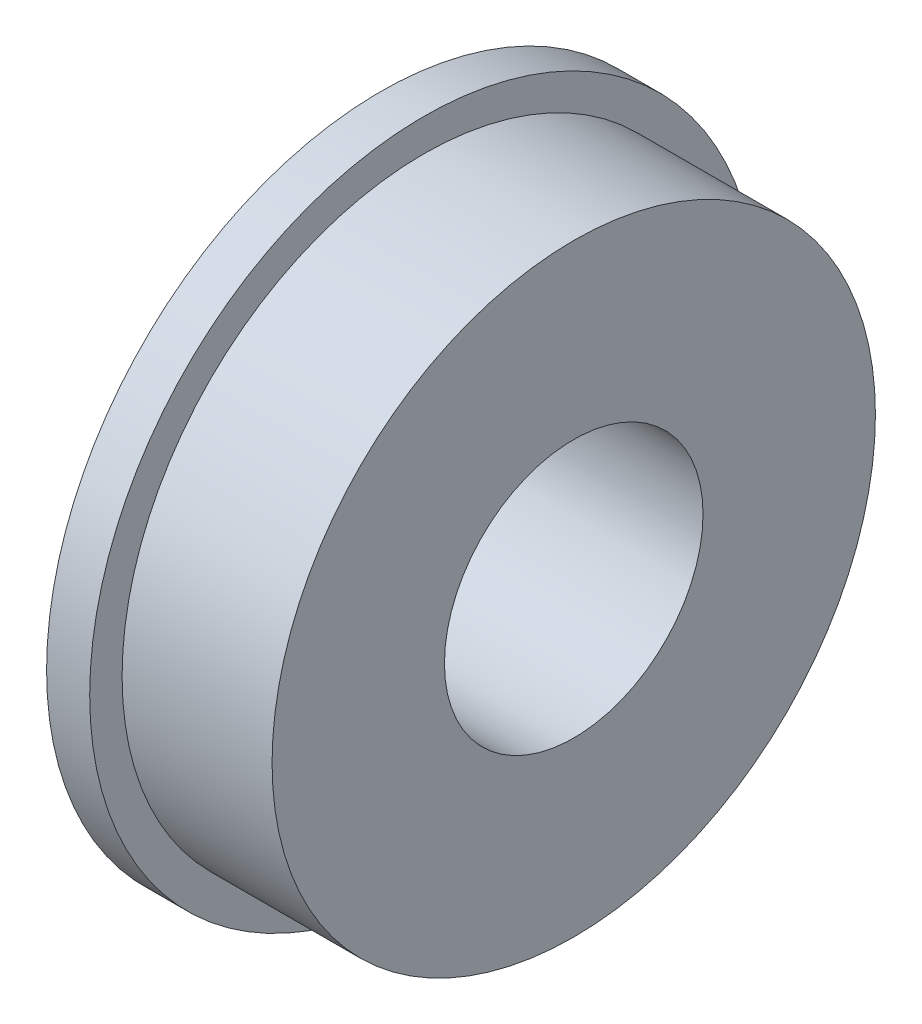
ISO-10303-21;
HEADER;
FILE_DESCRIPTION(('STEP AP214'),'2;1');
FILE_NAME('part.step','',(''),(''),'','','');
FILE_SCHEMA(('AUTOMOTIVE_DESIGN { 1 0 10303 214 1 1 1 1 }'));
ENDSEC;
DATA;
#1=APPLICATION_CONTEXT('core data for automotive mechanical design processes');
#2=APPLICATION_PROTOCOL_DEFINITION('international standard','automotive_design',2000,#1);
#3=PRODUCT_CONTEXT('',#1,'mechanical');
#4=PRODUCT('Part','Part','',(#3));
#5=PRODUCT_RELATED_PRODUCT_CATEGORY('part','',(#4));
#6=PRODUCT_DEFINITION_FORMATION('','',#4);
#7=PRODUCT_DEFINITION_CONTEXT('part definition',#1,'design');
#8=PRODUCT_DEFINITION('design','',#6,#7);
#9=PRODUCT_DEFINITION_SHAPE('','',#8);
#10=(LENGTH_UNIT() NAMED_UNIT(*) SI_UNIT(.MILLI.,.METRE.));
#11=(NAMED_UNIT(*) PLANE_ANGLE_UNIT() SI_UNIT($,.RADIAN.));
#12=(NAMED_UNIT(*) SI_UNIT($,.STERADIAN.) SOLID_ANGLE_UNIT());
#13=UNCERTAINTY_MEASURE_WITH_UNIT(LENGTH_MEASURE(1.E-05),#10,'distance_accuracy_value','');
#14=(GEOMETRIC_REPRESENTATION_CONTEXT(3) GLOBAL_UNCERTAINTY_ASSIGNED_CONTEXT((#13)) GLOBAL_UNIT_ASSIGNED_CONTEXT((#10,
#11,#12)) REPRESENTATION_CONTEXT('',''));
#15=CARTESIAN_POINT('',(0.,0.,0.));
#16=DIRECTION('',(0.,0.,1.));
#17=DIRECTION('',(1.,0.,0.));
#18=AXIS2_PLACEMENT_3D('',#15,#16,#17);
#19=CARTESIAN_POINT('',(0.,0.,0.));
#20=DIRECTION('',(-1.,0.,0.));
#21=DIRECTION('',(0.,0.,1.));
#22=AXIS2_PLACEMENT_3D('',#19,#20,#21);
#23=CYLINDRICAL_SURFACE('',#22,9.906);
#24=CARTESIAN_POINT('',(0.381,0.,0.));
#25=DIRECTION('',(-1.,0.,0.));
#26=DIRECTION('',(0.,0.,1.));
#27=AXIS2_PLACEMENT_3D('',#24,#25,#26);
#28=CIRCLE('',#27,9.906);
#29=CARTESIAN_POINT('',(0.381,0.,9.906));
#30=VERTEX_POINT('',#29);
#31=EDGE_CURVE('E46',#30,#30,#28,.F.);
#32=ORIENTED_EDGE('',*,*,#31,.T.);
#33=EDGE_LOOP('',(#32));
#34=FACE_BOUND('',#33,.T.);
#35=CARTESIAN_POINT('',(0.,0.,0.));
#36=DIRECTION('',(-1.,0.,0.));
#37=DIRECTION('',(0.,0.,1.));
#38=AXIS2_PLACEMENT_3D('',#35,#36,#37);
#39=CIRCLE('',#38,9.906);
#40=CARTESIAN_POINT('',(0.,0.,9.906));
#41=VERTEX_POINT('',#40);
#42=EDGE_CURVE('E18',#41,#41,#39,.T.);
#43=ORIENTED_EDGE('',*,*,#42,.T.);
#44=EDGE_LOOP('',(#43));
#45=FACE_BOUND('',#44,.T.);
#46=ADVANCED_FACE('F15',(#34,#45),#23,.F.);
#47=CARTESIAN_POINT('',(0.,12.3063,0.));
#48=DIRECTION('',(1.,0.,0.));
#49=DIRECTION('',(0.,0.,-1.));
#50=AXIS2_PLACEMENT_3D('',#47,#48,#49);
#51=PLANE('',#50);
#52=CARTESIAN_POINT('',(0.,0.,0.));
#53=DIRECTION('',(-1.,0.,0.));
#54=DIRECTION('',(0.,0.,1.));
#55=AXIS2_PLACEMENT_3D('',#52,#53,#54);
#56=CIRCLE('',#55,12.3063);
#57=CARTESIAN_POINT('',(0.,0.,12.3063));
#58=VERTEX_POINT('',#57);
#59=EDGE_CURVE('E44',#58,#58,#56,.F.);
#60=ORIENTED_EDGE('',*,*,#59,.F.);
#61=EDGE_LOOP('',(#60));
#62=FACE_BOUND('',#61,.T.);
#63=ORIENTED_EDGE('',*,*,#42,.F.);
#64=EDGE_LOOP('',(#63));
#65=FACE_BOUND('',#64,.T.);
#66=ADVANCED_FACE('F54',(#62,#65),#51,.F.);
#67=CARTESIAN_POINT('',(0.381,9.906,0.));
#68=DIRECTION('',(1.,0.,0.));
#69=DIRECTION('',(0.,0.,-1.));
#70=AXIS2_PLACEMENT_3D('',#67,#68,#69);
#71=PLANE('',#70);
#72=ORIENTED_EDGE('',*,*,#31,.F.);
#73=EDGE_LOOP('',(#72));
#74=FACE_BOUND('',#73,.T.);
#75=CARTESIAN_POINT('',(0.381,0.,0.));
#76=DIRECTION('',(-1.,0.,0.));
#77=DIRECTION('',(0.,0.,1.));
#78=AXIS2_PLACEMENT_3D('',#75,#76,#77);
#79=CIRCLE('',#78,6.35);
#80=CARTESIAN_POINT('',(0.381,0.,6.35));
#81=VERTEX_POINT('',#80);
#82=EDGE_CURVE('E41',#81,#81,#79,.T.);
#83=ORIENTED_EDGE('',*,*,#82,.F.);
#84=EDGE_LOOP('',(#83));
#85=FACE_BOUND('',#84,.T.);
#86=ADVANCED_FACE('F56',(#74,#85),#71,.F.);
#87=CARTESIAN_POINT('',(0.,0.,0.));
#88=DIRECTION('',(-1.,0.,0.));
#89=DIRECTION('',(0.,0.,1.));
#90=AXIS2_PLACEMENT_3D('',#87,#88,#89);
#91=CYLINDRICAL_SURFACE('',#90,12.3063);
#92=ORIENTED_EDGE('',*,*,#59,.T.);
#93=EDGE_LOOP('',(#92));
#94=FACE_BOUND('',#93,.T.);
#95=CARTESIAN_POINT('',(1.5875,0.,0.));
#96=DIRECTION('',(-1.,0.,0.));
#97=DIRECTION('',(0.,0.,1.));
#98=AXIS2_PLACEMENT_3D('',#95,#96,#97);
#99=CIRCLE('',#98,12.3063);
#100=CARTESIAN_POINT('',(1.5875,0.,12.3063));
#101=VERTEX_POINT('',#100);
#102=EDGE_CURVE('E38',#101,#101,#99,.T.);
#103=ORIENTED_EDGE('',*,*,#102,.T.);
#104=EDGE_LOOP('',(#103));
#105=FACE_BOUND('',#104,.T.);
#106=ADVANCED_FACE('F63',(#94,#105),#91,.T.);
#107=CARTESIAN_POINT('',(0.,0.,0.));
#108=DIRECTION('',(-1.,0.,0.));
#109=DIRECTION('',(0.,0.,1.));
#110=AXIS2_PLACEMENT_3D('',#107,#108,#109);
#111=CYLINDRICAL_SURFACE('',#110,6.35);
#112=CARTESIAN_POINT('',(0.,0.,0.));
#113=DIRECTION('',(-1.,0.,0.));
#114=DIRECTION('',(0.,0.,1.));
#115=AXIS2_PLACEMENT_3D('',#112,#113,#114);
#116=CIRCLE('',#115,6.35);
#117=CARTESIAN_POINT('',(0.,0.,6.35));
#118=VERTEX_POINT('',#117);
#119=EDGE_CURVE('E35',#118,#118,#116,.F.);
#120=ORIENTED_EDGE('',*,*,#119,.T.);
#121=EDGE_LOOP('',(#120));
#122=FACE_BOUND('',#121,.T.);
#123=ORIENTED_EDGE('',*,*,#82,.T.);
#124=EDGE_LOOP('',(#123));
#125=FACE_BOUND('',#124,.T.);
#126=ADVANCED_FACE('F89',(#122,#125),#111,.T.);
#127=CARTESIAN_POINT('',(1.5875,11.1125,0.));
#128=DIRECTION('',(-1.,0.,0.));
#129=DIRECTION('',(0.,0.,1.));
#130=AXIS2_PLACEMENT_3D('',#127,#128,#129);
#131=PLANE('',#130);
#132=CARTESIAN_POINT('',(1.5875,0.,0.));
#133=DIRECTION('',(-1.,0.,0.));
#134=DIRECTION('',(0.,0.,1.));
#135=AXIS2_PLACEMENT_3D('',#132,#133,#134);
#136=CIRCLE('',#135,11.1125);
#137=CARTESIAN_POINT('',(1.5875,0.,11.1125));
#138=VERTEX_POINT('',#137);
#139=EDGE_CURVE('E32',#138,#138,#136,.F.);
#140=ORIENTED_EDGE('',*,*,#139,.F.);
#141=EDGE_LOOP('',(#140));
#142=FACE_BOUND('',#141,.T.);
#143=ORIENTED_EDGE('',*,*,#102,.F.);
#144=EDGE_LOOP('',(#143));
#145=FACE_BOUND('',#144,.T.);
#146=ADVANCED_FACE('F85',(#142,#145),#131,.F.);
#147=CARTESIAN_POINT('',(0.,6.35,0.));
#148=DIRECTION('',(1.,0.,0.));
#149=DIRECTION('',(0.,0.,-1.));
#150=AXIS2_PLACEMENT_3D('',#147,#148,#149);
#151=PLANE('',#150);
#152=ORIENTED_EDGE('',*,*,#119,.F.);
#153=EDGE_LOOP('',(#152));
#154=FACE_BOUND('',#153,.T.);
#155=CARTESIAN_POINT('',(0.,0.,0.));
#156=DIRECTION('',(-1.,0.,0.));
#157=DIRECTION('',(0.,0.,1.));
#158=AXIS2_PLACEMENT_3D('',#155,#156,#157);
#159=CIRCLE('',#158,4.7625);
#160=CARTESIAN_POINT('',(0.,0.,4.7625));
#161=VERTEX_POINT('',#160);
#162=EDGE_CURVE('E27',#161,#161,#159,.F.);
#163=ORIENTED_EDGE('',*,*,#162,.T.);
#164=EDGE_LOOP('',(#163));
#165=FACE_BOUND('',#164,.T.);
#166=ADVANCED_FACE('F81',(#154,#165),#151,.F.);
#167=CARTESIAN_POINT('',(0.,0.,0.));
#168=DIRECTION('',(-1.,0.,0.));
#169=DIRECTION('',(0.,0.,1.));
#170=AXIS2_PLACEMENT_3D('',#167,#168,#169);
#171=CYLINDRICAL_SURFACE('',#170,11.1125);
#172=ORIENTED_EDGE('',*,*,#139,.T.);
#173=EDGE_LOOP('',(#172));
#174=FACE_BOUND('',#173,.T.);
#175=CARTESIAN_POINT('',(7.112,0.,0.));
#176=DIRECTION('',(-1.,0.,0.));
#177=DIRECTION('',(0.,0.,1.));
#178=AXIS2_PLACEMENT_3D('',#175,#176,#177);
#179=CIRCLE('',#178,11.1125);
#180=CARTESIAN_POINT('',(7.112,0.,11.1125));
#181=VERTEX_POINT('',#180);
#182=EDGE_CURVE('E22',#181,#181,#179,.T.);
#183=ORIENTED_EDGE('',*,*,#182,.T.);
#184=EDGE_LOOP('',(#183));
#185=FACE_BOUND('',#184,.T.);
#186=ADVANCED_FACE('F75',(#174,#185),#171,.T.);
#187=CARTESIAN_POINT('',(0.,0.,0.));
#188=DIRECTION('',(-1.,0.,0.));
#189=DIRECTION('',(0.,0.,1.));
#190=AXIS2_PLACEMENT_3D('',#187,#188,#189);
#191=CYLINDRICAL_SURFACE('',#190,4.7625);
#192=CARTESIAN_POINT('',(7.112,0.,0.));
#193=DIRECTION('',(-1.,0.,0.));
#194=DIRECTION('',(0.,0.,1.));
#195=AXIS2_PLACEMENT_3D('',#192,#193,#194);
#196=CIRCLE('',#195,4.7625);
#197=CARTESIAN_POINT('',(7.112,0.,4.7625));
#198=VERTEX_POINT('',#197);
#199=EDGE_CURVE('E10',#198,#198,#196,.F.);
#200=ORIENTED_EDGE('',*,*,#199,.T.);
#201=EDGE_LOOP('',(#200));
#202=FACE_BOUND('',#201,.T.);
#203=ORIENTED_EDGE('',*,*,#162,.F.);
#204=EDGE_LOOP('',(#203));
#205=FACE_BOUND('',#204,.T.);
#206=ADVANCED_FACE('F69',(#202,#205),#191,.F.);
#207=CARTESIAN_POINT('',(7.112,4.7625,0.));
#208=DIRECTION('',(-1.,0.,0.));
#209=DIRECTION('',(0.,0.,1.));
#210=AXIS2_PLACEMENT_3D('',#207,#208,#209);
#211=PLANE('',#210);
#212=ORIENTED_EDGE('',*,*,#199,.F.);
#213=EDGE_LOOP('',(#212));
#214=FACE_BOUND('',#213,.T.);
#215=ORIENTED_EDGE('',*,*,#182,.F.);
#216=EDGE_LOOP('',(#215));
#217=FACE_BOUND('',#216,.T.);
#218=ADVANCED_FACE('F67',(#214,#217),#211,.F.);
#219=CLOSED_SHELL('',(#46,#66,#86,#106,#126,#146,#166,#186,#206,#218));
#220=MANIFOLD_SOLID_BREP('B1',#219);
#221=ADVANCED_BREP_SHAPE_REPRESENTATION('',(#18,#220),#14);
#222=SHAPE_DEFINITION_REPRESENTATION(#9,#221);
ENDSEC;
END-ISO-10303-21;
